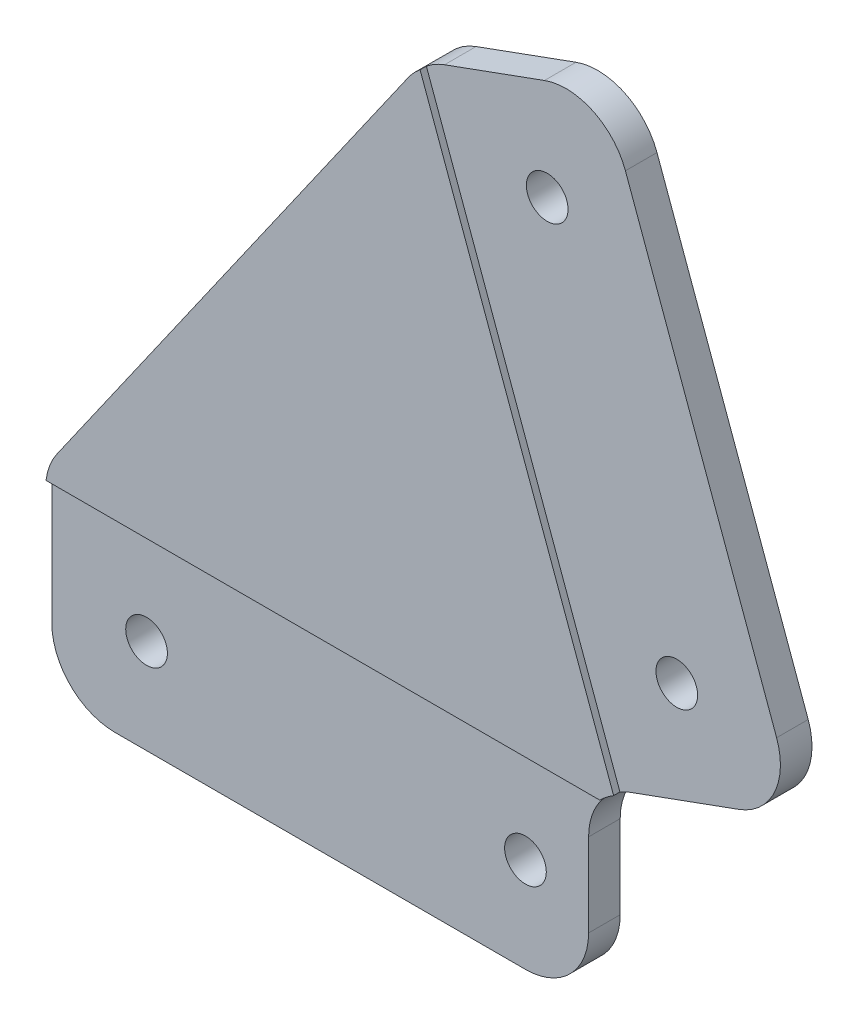
ISO-10303-21;
HEADER;
FILE_DESCRIPTION(('STEP AP214'),'2;1');
FILE_NAME('part.step','',(''),(''),'','','');
FILE_SCHEMA(('AUTOMOTIVE_DESIGN { 1 0 10303 214 1 1 1 1 }'));
ENDSEC;
DATA;
#1=APPLICATION_CONTEXT('core data for automotive mechanical design processes');
#2=APPLICATION_PROTOCOL_DEFINITION('international standard','automotive_design',2000,#1);
#3=PRODUCT_CONTEXT('',#1,'mechanical');
#4=PRODUCT('Part','Part','',(#3));
#5=PRODUCT_RELATED_PRODUCT_CATEGORY('part','',(#4));
#6=PRODUCT_DEFINITION_FORMATION('','',#4);
#7=PRODUCT_DEFINITION_CONTEXT('part definition',#1,'design');
#8=PRODUCT_DEFINITION('design','',#6,#7);
#9=PRODUCT_DEFINITION_SHAPE('','',#8);
#10=(LENGTH_UNIT() NAMED_UNIT(*) SI_UNIT(.MILLI.,.METRE.));
#11=(NAMED_UNIT(*) PLANE_ANGLE_UNIT() SI_UNIT($,.RADIAN.));
#12=(NAMED_UNIT(*) SI_UNIT($,.STERADIAN.) SOLID_ANGLE_UNIT());
#13=UNCERTAINTY_MEASURE_WITH_UNIT(LENGTH_MEASURE(1.E-05),#10,'distance_accuracy_value','');
#14=(GEOMETRIC_REPRESENTATION_CONTEXT(3) GLOBAL_UNCERTAINTY_ASSIGNED_CONTEXT((#13)) GLOBAL_UNIT_ASSIGNED_CONTEXT((#10,
#11,#12)) REPRESENTATION_CONTEXT('',''));
#15=CARTESIAN_POINT('',(0.,0.,0.));
#16=DIRECTION('',(0.,0.,1.));
#17=DIRECTION('',(1.,0.,0.));
#18=AXIS2_PLACEMENT_3D('',#15,#16,#17);
#19=CARTESIAN_POINT('',(51.4702225138264,-141.41327413104,3.));
#20=DIRECTION('',(0.342020143325674,-0.939692620785906,0.));
#21=DIRECTION('',(0.939692620785907,0.342020143325674,0.));
#22=AXIS2_PLACEMENT_3D('',#19,#20,#21);
#23=PLANE('',#22);
#24=DIRECTION('',(0.,0.,-1.));
#25=VECTOR('',#24,1.);
#26=CARTESIAN_POINT('',(449.396926207859,3.42020143325676,3.));
#27=LINE('',#26,#25);
#28=CARTESIAN_POINT('',(449.396926207859,3.42020143325675,0.));
#29=VERTEX_POINT('',#28);
#30=CARTESIAN_POINT('',(449.396926207859,3.42020143325676,2.5));
#31=VERTEX_POINT('',#30);
#32=EDGE_CURVE('E264',#29,#31,#27,.F.);
#33=ORIENTED_EDGE('',*,*,#32,.T.);
#34=DIRECTION('',(-0.939692620785907,-0.342020143325674,0.));
#35=VECTOR('',#34,1.);
#36=CARTESIAN_POINT('',(51.4702225138264,-141.41327413104,2.5));
#37=LINE('',#36,#35);
#38=CARTESIAN_POINT('',(440.789899283372,0.287499827215487,2.5));
#39=VERTEX_POINT('',#38);
#40=EDGE_CURVE('E327',#31,#39,#37,.T.);
#41=ORIENTED_EDGE('',*,*,#40,.T.);
#42=DIRECTION('',(0.,0.,-1.));
#43=VECTOR('',#42,1.);
#44=CARTESIAN_POINT('',(440.789899283372,0.287499827215478,0.));
#45=LINE('',#44,#43);
#46=CARTESIAN_POINT('',(440.789899283372,0.287499827215487,0.));
#47=VERTEX_POINT('',#46);
#48=EDGE_CURVE('E267',#39,#47,#45,.T.);
#49=ORIENTED_EDGE('',*,*,#48,.T.);
#50=DIRECTION('',(-0.939692620785907,-0.342020143325674,0.));
#51=VECTOR('',#50,1.);
#52=CARTESIAN_POINT('',(51.4702225138264,-141.41327413104,0.));
#53=LINE('',#52,#51);
#54=EDGE_CURVE('E355',#29,#47,#53,.T.);
#55=ORIENTED_EDGE('',*,*,#54,.F.);
#56=EDGE_LOOP('',(#33,#41,#49,#55));
#57=FACE_BOUND('',#56,.T.);
#58=ADVANCED_FACE('F49',(#57),#23,.T.);
#59=CARTESIAN_POINT('',(402.625166797963,146.543576280925,3.));
#60=DIRECTION('',(-0.939692620785907,-0.342020143325672,0.));
#61=DIRECTION('',(0.342020143325672,-0.939692620785907,0.));
#62=AXIS2_PLACEMENT_3D('',#59,#60,#61);
#63=PLANE('',#62);
#64=DIRECTION('',(-0.342020143325672,0.939692620785907,0.));
#65=VECTOR('',#64,1.);
#66=CARTESIAN_POINT('',(438.704482862133,47.416470085251,2.5));
#67=LINE('',#66,#65);
#68=CARTESIAN_POINT('',(452.38528859516,9.82876525381463,2.5));
#69=VERTEX_POINT('',#68);
#70=CARTESIAN_POINT('',(440.414583578762,42.7180069813214,2.5));
#71=VERTEX_POINT('',#70);
#72=EDGE_CURVE('E369',#69,#71,#67,.T.);
#73=ORIENTED_EDGE('',*,*,#72,.F.);
#74=DIRECTION('',(0.,0.,-1.));
#75=VECTOR('',#74,1.);
#76=CARTESIAN_POINT('',(452.38528859516,9.82876525381463,0.));
#77=LINE('',#76,#75);
#78=CARTESIAN_POINT('',(452.38528859516,9.82876525381463,0.));
#79=VERTEX_POINT('',#78);
#80=EDGE_CURVE('E277',#69,#79,#77,.T.);
#81=ORIENTED_EDGE('',*,*,#80,.T.);
#82=DIRECTION('',(-0.342020143325672,0.939692620785907,0.));
#83=VECTOR('',#82,1.);
#84=CARTESIAN_POINT('',(402.625166797963,146.543576280925,0.));
#85=LINE('',#84,#83);
#86=CARTESIAN_POINT('',(440.414583578762,42.7180069813214,0.));
#87=VERTEX_POINT('',#86);
#88=EDGE_CURVE('E258',#79,#87,#85,.T.);
#89=ORIENTED_EDGE('',*,*,#88,.T.);
#90=DIRECTION('',(0.,0.,-1.));
#91=VECTOR('',#90,1.);
#92=CARTESIAN_POINT('',(440.414583578762,42.7180069813214,3.));
#93=LINE('',#92,#91);
#94=EDGE_CURVE('E274',#87,#71,#93,.F.);
#95=ORIENTED_EDGE('',*,*,#94,.T.);
#96=EDGE_LOOP('',(#73,#81,#89,#95));
#97=FACE_BOUND('',#96,.T.);
#98=ADVANCED_FACE('F361',(#97),#63,.F.);
#99=CARTESIAN_POINT('',(36.0793160641703,-99.1271061956736,3.));
#100=DIRECTION('',(-0.342020143325671,0.939692620785908,0.));
#101=DIRECTION('',(-0.939692620785908,-0.342020143325671,0.));
#102=AXIS2_PLACEMENT_3D('',#99,#100,#101);
#103=PLANE('',#102);
#104=DIRECTION('',(0.,0.,-1.));
#105=VECTOR('',#104,1.);
#106=CARTESIAN_POINT('',(426.090513276606,42.8253606201798,3.));
#107=LINE('',#106,#105);
#108=CARTESIAN_POINT('',(426.090513276606,42.8253606201799,0.));
#109=VERTEX_POINT('',#108);
#110=CARTESIAN_POINT('',(426.090513276606,42.8253606201798,2.5));
#111=VERTEX_POINT('',#110);
#112=EDGE_CURVE('E216',#109,#111,#107,.F.);
#113=ORIENTED_EDGE('',*,*,#112,.T.);
#114=DIRECTION('',(-0.939692620785907,-0.342020143325672,0.));
#115=VECTOR('',#114,1.);
#116=CARTESIAN_POINT('',(438.704482862133,47.416470085251,2.5));
#117=LINE('',#116,#115);
#118=CARTESIAN_POINT('',(434.006019758204,45.7063693686226,2.5));
#119=VERTEX_POINT('',#118);
#120=EDGE_CURVE('E64',#119,#111,#117,.T.);
#121=ORIENTED_EDGE('',*,*,#120,.F.);
#122=DIRECTION('',(0.,0.,-1.));
#123=VECTOR('',#122,1.);
#124=CARTESIAN_POINT('',(434.006019758204,45.7063693686226,0.));
#125=LINE('',#124,#123);
#126=CARTESIAN_POINT('',(434.006019758204,45.7063693686227,0.));
#127=VERTEX_POINT('',#126);
#128=EDGE_CURVE('E226',#119,#127,#125,.T.);
#129=ORIENTED_EDGE('',*,*,#128,.T.);
#130=DIRECTION('',(0.939692620785908,0.342020143325671,0.));
#131=VECTOR('',#130,1.);
#132=CARTESIAN_POINT('',(36.0793160641703,-99.1271061956736,0.));
#133=LINE('',#132,#131);
#134=EDGE_CURVE('E225',#109,#127,#133,.T.);
#135=ORIENTED_EDGE('',*,*,#134,.F.);
#136=EDGE_LOOP('',(#113,#121,#129,#135));
#137=FACE_BOUND('',#136,.T.);
#138=ADVANCED_FACE('F222',(#137),#103,.T.);
#139=CARTESIAN_POINT('',(444.482543580952,9.61284573083691,0.));
#140=DIRECTION('',(0.,0.,1.));
#141=DIRECTION('',(1.,0.,0.));
#142=AXIS2_PLACEMENT_3D('',#139,#140,#141);
#143=CYLINDRICAL_SURFACE('',#142,1.64999999999999);
#144=CARTESIAN_POINT('',(444.482543580952,9.61284573083691,0.));
#145=DIRECTION('',(0.,0.,1.));
#146=DIRECTION('',(1.,0.,0.));
#147=AXIS2_PLACEMENT_3D('',#144,#145,#146);
#148=CIRCLE('',#147,1.64999999999999);
#149=CARTESIAN_POINT('',(446.132543580952,9.61284573083691,0.));
#150=VERTEX_POINT('',#149);
#151=EDGE_CURVE('E339',#150,#150,#148,.T.);
#152=ORIENTED_EDGE('',*,*,#151,.F.);
#153=EDGE_LOOP('',(#152));
#154=FACE_BOUND('',#153,.T.);
#155=CARTESIAN_POINT('',(444.482543580952,9.61284573083691,2.5));
#156=DIRECTION('',(0.,0.,1.));
#157=DIRECTION('',(1.,0.,0.));
#158=AXIS2_PLACEMENT_3D('',#155,#156,#157);
#159=CIRCLE('',#158,1.64999999999999);
#160=CARTESIAN_POINT('',(446.132543580952,9.61284573083691,2.5));
#161=VERTEX_POINT('',#160);
#162=EDGE_CURVE('E335',#161,#161,#159,.F.);
#163=ORIENTED_EDGE('',*,*,#162,.F.);
#164=EDGE_LOOP('',(#163));
#165=FACE_BOUND('',#164,.T.);
#166=ADVANCED_FACE('F399',(#154,#165),#143,.F.);
#167=CARTESIAN_POINT('',(434.221939281182,37.8036243544141,0.));
#168=DIRECTION('',(0.,0.,1.));
#169=DIRECTION('',(1.,0.,0.));
#170=AXIS2_PLACEMENT_3D('',#167,#168,#169);
#171=CYLINDRICAL_SURFACE('',#170,1.64999999999999);
#172=CARTESIAN_POINT('',(434.221939281182,37.8036243544141,0.));
#173=DIRECTION('',(0.,0.,1.));
#174=DIRECTION('',(1.,0.,0.));
#175=AXIS2_PLACEMENT_3D('',#172,#173,#174);
#176=CIRCLE('',#175,1.64999999999999);
#177=CARTESIAN_POINT('',(435.871939281182,37.8036243544141,0.));
#178=VERTEX_POINT('',#177);
#179=EDGE_CURVE('E347',#178,#178,#176,.T.);
#180=ORIENTED_EDGE('',*,*,#179,.F.);
#181=EDGE_LOOP('',(#180));
#182=FACE_BOUND('',#181,.T.);
#183=CARTESIAN_POINT('',(434.221939281182,37.8036243544141,2.5));
#184=DIRECTION('',(0.,0.,1.));
#185=DIRECTION('',(1.,0.,0.));
#186=AXIS2_PLACEMENT_3D('',#183,#184,#185);
#187=CIRCLE('',#186,1.64999999999999);
#188=CARTESIAN_POINT('',(435.871939281182,37.8036243544141,2.5));
#189=VERTEX_POINT('',#188);
#190=EDGE_CURVE('E332',#189,#189,#187,.F.);
#191=ORIENTED_EDGE('',*,*,#190,.F.);
#192=EDGE_LOOP('',(#191));
#193=FACE_BOUND('',#192,.T.);
#194=ADVANCED_FACE('F392',(#182,#193),#171,.F.);
#195=CARTESIAN_POINT('',(447.686825491231,8.11866453718629,3.));
#196=DIRECTION('',(0.,0.,1.));
#197=DIRECTION('',(1.,0.,0.));
#198=AXIS2_PLACEMENT_3D('',#195,#196,#197);
#199=CYLINDRICAL_SURFACE('',#198,5.);
#200=ORIENTED_EDGE('',*,*,#80,.F.);
#201=CARTESIAN_POINT('',(447.686825491231,8.11866453718629,2.5));
#202=DIRECTION('',(0.,0.,1.));
#203=DIRECTION('',(1.,0.,0.));
#204=AXIS2_PLACEMENT_3D('',#201,#202,#203);
#205=CIRCLE('',#204,5.);
#206=EDGE_CURVE('E324',#69,#31,#205,.F.);
#207=ORIENTED_EDGE('',*,*,#206,.T.);
#208=ORIENTED_EDGE('',*,*,#32,.F.);
#209=CARTESIAN_POINT('',(447.686825491231,8.11866453718629,0.));
#210=DIRECTION('',(0.,0.,1.));
#211=DIRECTION('',(1.,0.,0.));
#212=AXIS2_PLACEMENT_3D('',#209,#210,#211);
#213=CIRCLE('',#212,5.);
#214=EDGE_CURVE('E287',#79,#29,#213,.F.);
#215=ORIENTED_EDGE('',*,*,#214,.F.);
#216=EDGE_LOOP('',(#200,#207,#208,#215));
#217=FACE_BOUND('',#216,.T.);
#218=ADVANCED_FACE('F390',(#217),#199,.T.);
#219=CARTESIAN_POINT('',(435.716120474832,41.0079062646931,3.));
#220=DIRECTION('',(0.,0.,1.));
#221=DIRECTION('',(1.,0.,0.));
#222=AXIS2_PLACEMENT_3D('',#219,#220,#221);
#223=CYLINDRICAL_SURFACE('',#222,5.);
#224=ORIENTED_EDGE('',*,*,#128,.F.);
#225=CARTESIAN_POINT('',(435.716120474832,41.0079062646931,2.5));
#226=DIRECTION('',(0.,0.,1.));
#227=DIRECTION('',(1.,0.,0.));
#228=AXIS2_PLACEMENT_3D('',#225,#226,#227);
#229=CIRCLE('',#228,5.);
#230=EDGE_CURVE('E183',#119,#71,#229,.F.);
#231=ORIENTED_EDGE('',*,*,#230,.T.);
#232=ORIENTED_EDGE('',*,*,#94,.F.);
#233=CARTESIAN_POINT('',(435.716120474832,41.0079062646931,0.));
#234=DIRECTION('',(0.,0.,1.));
#235=DIRECTION('',(1.,0.,0.));
#236=AXIS2_PLACEMENT_3D('',#233,#234,#235);
#237=CIRCLE('',#236,5.);
#238=EDGE_CURVE('E283',#127,#87,#237,.F.);
#239=ORIENTED_EDGE('',*,*,#238,.F.);
#240=EDGE_LOOP('',(#224,#231,#232,#239));
#241=FACE_BOUND('',#240,.T.);
#242=ADVANCED_FACE('F366',(#241),#223,.T.);
#243=CARTESIAN_POINT('',(437.5,0.,3.));
#244=DIRECTION('',(1.,0.,0.));
#245=DIRECTION('',(0.,0.,-1.));
#246=AXIS2_PLACEMENT_3D('',#243,#244,#245);
#247=PLANE('',#246);
#248=DIRECTION('',(0.,1.,0.));
#249=VECTOR('',#248,1.);
#250=CARTESIAN_POINT('',(437.5,0.,2.5));
#251=LINE('',#250,#249);
#252=CARTESIAN_POINT('',(437.5,-11.0000000000001,2.5));
#253=VERTEX_POINT('',#252);
#254=CARTESIAN_POINT('',(437.5,-4.41096327671406,2.5));
#255=VERTEX_POINT('',#254);
#256=EDGE_CURVE('E370',#253,#255,#251,.T.);
#257=ORIENTED_EDGE('',*,*,#256,.F.);
#258=DIRECTION('',(0.,0.,-1.));
#259=VECTOR('',#258,1.);
#260=CARTESIAN_POINT('',(437.5,-11.0000000000001,3.));
#261=LINE('',#260,#259);
#262=CARTESIAN_POINT('',(437.5,-11.0000000000001,0.));
#263=VERTEX_POINT('',#262);
#264=EDGE_CURVE('E269',#253,#263,#261,.T.);
#265=ORIENTED_EDGE('',*,*,#264,.T.);
#266=DIRECTION('',(0.,-1.,0.));
#267=VECTOR('',#266,1.);
#268=CARTESIAN_POINT('',(437.5,0.,0.));
#269=LINE('',#268,#267);
#270=CARTESIAN_POINT('',(437.5,-4.41096327671406,0.));
#271=VERTEX_POINT('',#270);
#272=EDGE_CURVE('E343',#271,#263,#269,.T.);
#273=ORIENTED_EDGE('',*,*,#272,.F.);
#274=DIRECTION('',(0.,0.,-1.));
#275=VECTOR('',#274,1.);
#276=CARTESIAN_POINT('',(437.5,-4.41096327671406,3.));
#277=LINE('',#276,#275);
#278=EDGE_CURVE('E271',#271,#255,#277,.F.);
#279=ORIENTED_EDGE('',*,*,#278,.T.);
#280=EDGE_LOOP('',(#257,#265,#273,#279));
#281=FACE_BOUND('',#280,.T.);
#282=ADVANCED_FACE('F382',(#281),#247,.T.);
#283=CARTESIAN_POINT('',(265.048978306821,-185.589292605216,3.));
#284=DIRECTION('',(0.819152044288994,-0.573576436351042,0.));
#285=DIRECTION('',(0.573576436351042,0.819152044288994,0.));
#286=AXIS2_PLACEMENT_3D('',#283,#284,#285);
#287=PLANE('',#286);
#288=DIRECTION('',(-0.573576436351042,-0.819152044288994,0.));
#289=VECTOR('',#288,1.);
#290=CARTESIAN_POINT('',(265.048978306821,-185.589292605216,3.));
#291=LINE('',#290,#289);
#292=CARTESIAN_POINT('',(423.704853771789,40.9947796980054,3.));
#293=VERTEX_POINT('',#292);
#294=CARTESIAN_POINT('',(395.904239778555,1.29138823736039,3.));
#295=VERTEX_POINT('',#294);
#296=EDGE_CURVE('E245',#293,#295,#291,.T.);
#297=ORIENTED_EDGE('',*,*,#296,.F.);
#298=DIRECTION('',(0.,0.,-1.));
#299=VECTOR('',#298,1.);
#300=CARTESIAN_POINT('',(423.704853771789,40.9947796980055,0.));
#301=LINE('',#300,#299);
#302=CARTESIAN_POINT('',(423.704853771789,40.9947796980054,0.));
#303=VERTEX_POINT('',#302);
#304=EDGE_CURVE('E207',#293,#303,#301,.T.);
#305=ORIENTED_EDGE('',*,*,#304,.T.);
#306=DIRECTION('',(-0.573576436351042,-0.819152044288994,0.));
#307=VECTOR('',#306,1.);
#308=CARTESIAN_POINT('',(265.048978306821,-185.589292605216,0.));
#309=LINE('',#308,#307);
#310=CARTESIAN_POINT('',(395.904239778555,1.29138823736039,0.));
#311=VERTEX_POINT('',#310);
#312=EDGE_CURVE('E243',#303,#311,#309,.T.);
#313=ORIENTED_EDGE('',*,*,#312,.T.);
#314=DIRECTION('',(0.,0.,-1.));
#315=VECTOR('',#314,1.);
#316=CARTESIAN_POINT('',(395.904239778555,1.29138823736039,3.));
#317=LINE('',#316,#315);
#318=EDGE_CURVE('E229',#311,#295,#317,.F.);
#319=ORIENTED_EDGE('',*,*,#318,.T.);
#320=EDGE_LOOP('',(#297,#305,#313,#319));
#321=FACE_BOUND('',#320,.T.);
#322=ADVANCED_FACE('F242',(#321),#287,.F.);
#323=CARTESIAN_POINT('',(395.,0.,3.));
#324=DIRECTION('',(1.,0.,0.));
#325=DIRECTION('',(0.,0.,-1.));
#326=AXIS2_PLACEMENT_3D('',#323,#324,#325);
#327=PLANE('',#326);
#328=DIRECTION('',(0.,0.,-1.));
#329=VECTOR('',#328,1.);
#330=CARTESIAN_POINT('',(395.,-11.,3.));
#331=LINE('',#330,#329);
#332=CARTESIAN_POINT('',(395.,-11.,0.));
#333=VERTEX_POINT('',#332);
#334=CARTESIAN_POINT('',(395.,-11.,2.5));
#335=VERTEX_POINT('',#334);
#336=EDGE_CURVE('E227',#333,#335,#331,.F.);
#337=ORIENTED_EDGE('',*,*,#336,.T.);
#338=DIRECTION('',(0.,-1.,0.));
#339=VECTOR('',#338,1.);
#340=CARTESIAN_POINT('',(395.,-16.0000000000001,2.5));
#341=LINE('',#340,#339);
#342=CARTESIAN_POINT('',(395.,-1.57649394439481,2.5));
#343=VERTEX_POINT('',#342);
#344=EDGE_CURVE('E196',#343,#335,#341,.T.);
#345=ORIENTED_EDGE('',*,*,#344,.F.);
#346=DIRECTION('',(0.,0.,-1.));
#347=VECTOR('',#346,1.);
#348=CARTESIAN_POINT('',(395.,-1.57649394439481,3.));
#349=LINE('',#348,#347);
#350=CARTESIAN_POINT('',(395.,-1.57649394439481,0.));
#351=VERTEX_POINT('',#350);
#352=EDGE_CURVE('E232',#343,#351,#349,.T.);
#353=ORIENTED_EDGE('',*,*,#352,.T.);
#354=DIRECTION('',(0.,-1.,0.));
#355=VECTOR('',#354,1.);
#356=CARTESIAN_POINT('',(395.,0.,0.));
#357=LINE('',#356,#355);
#358=EDGE_CURVE('E253',#351,#333,#357,.T.);
#359=ORIENTED_EDGE('',*,*,#358,.T.);
#360=EDGE_LOOP('',(#337,#345,#353,#359));
#361=FACE_BOUND('',#360,.T.);
#362=ADVANCED_FACE('F299',(#361),#327,.F.);
#363=CARTESIAN_POINT('',(0.,-15.9999999999991,3.));
#364=DIRECTION('',(0.,-1.,0.));
#365=DIRECTION('',(1.,0.,0.));
#366=AXIS2_PLACEMENT_3D('',#363,#364,#365);
#367=PLANE('',#366);
#368=DIRECTION('',(1.,0.,0.));
#369=VECTOR('',#368,1.);
#370=CARTESIAN_POINT('',(395.,-16.0000000000001,2.5));
#371=LINE('',#370,#369);
#372=CARTESIAN_POINT('',(400.,-16.0000000000001,2.5));
#373=VERTEX_POINT('',#372);
#374=CARTESIAN_POINT('',(432.5,-16.0000000000001,2.5));
#375=VERTEX_POINT('',#374);
#376=EDGE_CURVE('E72',#373,#375,#371,.T.);
#377=ORIENTED_EDGE('',*,*,#376,.F.);
#378=DIRECTION('',(0.,0.,-1.));
#379=VECTOR('',#378,1.);
#380=CARTESIAN_POINT('',(400.,-16.,0.));
#381=LINE('',#380,#379);
#382=CARTESIAN_POINT('',(400.,-16.,0.));
#383=VERTEX_POINT('',#382);
#384=EDGE_CURVE('E295',#373,#383,#381,.T.);
#385=ORIENTED_EDGE('',*,*,#384,.T.);
#386=DIRECTION('',(-1.,0.,0.));
#387=VECTOR('',#386,1.);
#388=CARTESIAN_POINT('',(0.,-15.9999999999991,0.));
#389=LINE('',#388,#387);
#390=CARTESIAN_POINT('',(432.5,-16.0000000000001,0.));
#391=VERTEX_POINT('',#390);
#392=EDGE_CURVE('E256',#391,#383,#389,.T.);
#393=ORIENTED_EDGE('',*,*,#392,.F.);
#394=DIRECTION('',(0.,0.,-1.));
#395=VECTOR('',#394,1.);
#396=CARTESIAN_POINT('',(432.5,-16.0000000000001,3.));
#397=LINE('',#396,#395);
#398=EDGE_CURVE('E292',#391,#375,#397,.F.);
#399=ORIENTED_EDGE('',*,*,#398,.T.);
#400=EDGE_LOOP('',(#377,#385,#393,#399));
#401=FACE_BOUND('',#400,.T.);
#402=ADVANCED_FACE('F438',(#401),#367,.T.);
#403=CARTESIAN_POINT('',(0.,0.,3.));
#404=DIRECTION('',(0.,0.,1.));
#405=DIRECTION('',(1.,0.,0.));
#406=AXIS2_PLACEMENT_3D('',#403,#404,#405);
#407=PLANE('',#406);
#408=DIRECTION('',(-1.,0.,0.));
#409=VECTOR('',#408,1.);
#410=CARTESIAN_POINT('',(395.,-0.950000000000086,3.));
#411=LINE('',#410,#409);
#412=CARTESIAN_POINT('',(438.891436130919,-0.950000000000078,3.));
#413=VERTEX_POINT('',#412);
#414=CARTESIAN_POINT('',(395.039404739587,-0.950000000000086,3.));
#415=VERTEX_POINT('',#414);
#416=EDGE_CURVE('E176',#413,#415,#411,.T.);
#417=ORIENTED_EDGE('',*,*,#416,.F.);
#418=CARTESIAN_POINT('',(442.5,-4.41096327671406,3.));
#419=DIRECTION('',(0.,0.,1.));
#420=DIRECTION('',(1.,0.,0.));
#421=AXIS2_PLACEMENT_3D('',#418,#419,#420);
#422=CIRCLE('',#421,5.);
#423=CARTESIAN_POINT('',(439.980361560203,-0.0922340501130058,3.));
#424=VERTEX_POINT('',#423);
#425=EDGE_CURVE('E191',#413,#424,#422,.F.);
#426=ORIENTED_EDGE('',*,*,#425,.T.);
#427=DIRECTION('',(0.342020143325672,-0.939692620785907,0.));
#428=VECTOR('',#427,1.);
#429=CARTESIAN_POINT('',(424.562108919305,42.2690669281996,3.));
#430=LINE('',#429,#428);
#431=CARTESIAN_POINT('',(424.655119103751,42.0135235466566,3.));
#432=VERTEX_POINT('',#431);
#433=EDGE_CURVE('E195',#432,#424,#430,.T.);
#434=ORIENTED_EDGE('',*,*,#433,.F.);
#435=CARTESIAN_POINT('',(427.800613993234,38.1268975162503,3.));
#436=DIRECTION('',(0.,0.,1.));
#437=DIRECTION('',(1.,0.,0.));
#438=AXIS2_PLACEMENT_3D('',#435,#436,#437);
#439=CIRCLE('',#438,5.);
#440=EDGE_CURVE('E290',#432,#293,#439,.T.);
#441=ORIENTED_EDGE('',*,*,#440,.T.);
#442=ORIENTED_EDGE('',*,*,#296,.T.);
#443=CARTESIAN_POINT('',(400.,-1.57649394439481,3.));
#444=DIRECTION('',(0.,0.,1.));
#445=DIRECTION('',(1.,0.,0.));
#446=AXIS2_PLACEMENT_3D('',#443,#444,#445);
#447=CIRCLE('',#446,5.);
#448=EDGE_CURVE('E194',#295,#415,#447,.T.);
#449=ORIENTED_EDGE('',*,*,#448,.T.);
#450=EDGE_LOOP('',(#417,#426,#434,#441,#442,#449));
#451=FACE_BOUND('',#450,.T.);
#452=ADVANCED_FACE('F189',(#451),#407,.T.);
#453=CARTESIAN_POINT('',(0.,0.,0.));
#454=DIRECTION('',(0.,0.,1.));
#455=DIRECTION('',(1.,0.,0.));
#456=AXIS2_PLACEMENT_3D('',#453,#454,#455);
#457=PLANE('',#456);
#458=CARTESIAN_POINT('',(402.5,-8.5000000000001,0.));
#459=DIRECTION('',(0.,0.,1.));
#460=DIRECTION('',(1.,0.,0.));
#461=AXIS2_PLACEMENT_3D('',#458,#459,#460);
#462=CIRCLE('',#461,1.64999999999999);
#463=CARTESIAN_POINT('',(404.15,-8.5000000000001,0.));
#464=VERTEX_POINT('',#463);
#465=EDGE_CURVE('E340',#464,#464,#462,.T.);
#466=ORIENTED_EDGE('',*,*,#465,.T.);
#467=EDGE_LOOP('',(#466));
#468=FACE_BOUND('',#467,.T.);
#469=CARTESIAN_POINT('',(432.5,-8.5000000000001,0.));
#470=DIRECTION('',(0.,0.,1.));
#471=DIRECTION('',(1.,0.,0.));
#472=AXIS2_PLACEMENT_3D('',#469,#470,#471);
#473=CIRCLE('',#472,1.64999999999999);
#474=CARTESIAN_POINT('',(434.15,-8.5000000000001,0.));
#475=VERTEX_POINT('',#474);
#476=EDGE_CURVE('E344',#475,#475,#473,.T.);
#477=ORIENTED_EDGE('',*,*,#476,.T.);
#478=EDGE_LOOP('',(#477));
#479=FACE_BOUND('',#478,.T.);
#480=ORIENTED_EDGE('',*,*,#179,.T.);
#481=EDGE_LOOP('',(#480));
#482=FACE_BOUND('',#481,.T.);
#483=ORIENTED_EDGE('',*,*,#151,.T.);
#484=EDGE_LOOP('',(#483));
#485=FACE_BOUND('',#484,.T.);
#486=ORIENTED_EDGE('',*,*,#88,.F.);
#487=ORIENTED_EDGE('',*,*,#214,.T.);
#488=ORIENTED_EDGE('',*,*,#54,.T.);
#489=CARTESIAN_POINT('',(442.5,-4.41096327671406,0.));
#490=DIRECTION('',(0.,0.,1.));
#491=DIRECTION('',(1.,0.,0.));
#492=AXIS2_PLACEMENT_3D('',#489,#490,#491);
#493=CIRCLE('',#492,5.);
#494=EDGE_CURVE('E203',#47,#271,#493,.T.);
#495=ORIENTED_EDGE('',*,*,#494,.T.);
#496=ORIENTED_EDGE('',*,*,#272,.T.);
#497=CARTESIAN_POINT('',(432.5,-11.0000000000001,0.));
#498=DIRECTION('',(0.,0.,1.));
#499=DIRECTION('',(1.,0.,0.));
#500=AXIS2_PLACEMENT_3D('',#497,#498,#499);
#501=CIRCLE('',#500,5.);
#502=EDGE_CURVE('E279',#263,#391,#501,.F.);
#503=ORIENTED_EDGE('',*,*,#502,.T.);
#504=ORIENTED_EDGE('',*,*,#392,.T.);
#505=CARTESIAN_POINT('',(400.,-11.,0.));
#506=DIRECTION('',(0.,0.,1.));
#507=DIRECTION('',(1.,0.,0.));
#508=AXIS2_PLACEMENT_3D('',#505,#506,#507);
#509=CIRCLE('',#508,5.);
#510=EDGE_CURVE('E285',#383,#333,#509,.F.);
#511=ORIENTED_EDGE('',*,*,#510,.T.);
#512=ORIENTED_EDGE('',*,*,#358,.F.);
#513=CARTESIAN_POINT('',(400.,-1.57649394439481,0.));
#514=DIRECTION('',(0.,0.,1.));
#515=DIRECTION('',(1.,0.,0.));
#516=AXIS2_PLACEMENT_3D('',#513,#514,#515);
#517=CIRCLE('',#516,5.);
#518=EDGE_CURVE('E252',#351,#311,#517,.F.);
#519=ORIENTED_EDGE('',*,*,#518,.T.);
#520=ORIENTED_EDGE('',*,*,#312,.F.);
#521=CARTESIAN_POINT('',(427.800613993234,38.1268975162503,0.));
#522=DIRECTION('',(0.,0.,1.));
#523=DIRECTION('',(1.,0.,0.));
#524=AXIS2_PLACEMENT_3D('',#521,#522,#523);
#525=CIRCLE('',#524,5.);
#526=EDGE_CURVE('E249',#303,#109,#525,.F.);
#527=ORIENTED_EDGE('',*,*,#526,.T.);
#528=ORIENTED_EDGE('',*,*,#134,.T.);
#529=ORIENTED_EDGE('',*,*,#238,.T.);
#530=EDGE_LOOP('',(#486,#487,#488,#495,#496,#503,#504,#511,#512,#519,#520,#527,#528,#529));
#531=FACE_BOUND('',#530,.T.);
#532=ADVANCED_FACE('F248',(#468,#479,#482,#485,#531),#457,.F.);
#533=CARTESIAN_POINT('',(432.5,-8.5000000000001,0.));
#534=DIRECTION('',(0.,0.,1.));
#535=DIRECTION('',(1.,0.,0.));
#536=AXIS2_PLACEMENT_3D('',#533,#534,#535);
#537=CYLINDRICAL_SURFACE('',#536,1.64999999999999);
#538=CARTESIAN_POINT('',(432.5,-8.5000000000001,2.5));
#539=DIRECTION('',(0.,0.,-1.));
#540=DIRECTION('',(-1.,0.,0.));
#541=AXIS2_PLACEMENT_3D('',#538,#539,#540);
#542=CIRCLE('',#541,1.64999999999999);
#543=CARTESIAN_POINT('',(430.85,-8.5000000000001,2.5));
#544=VERTEX_POINT('',#543);
#545=EDGE_CURVE('E184',#544,#544,#542,.F.);
#546=ORIENTED_EDGE('',*,*,#545,.T.);
#547=EDGE_LOOP('',(#546));
#548=FACE_BOUND('',#547,.T.);
#549=ORIENTED_EDGE('',*,*,#476,.F.);
#550=EDGE_LOOP('',(#549));
#551=FACE_BOUND('',#550,.T.);
#552=ADVANCED_FACE('F420',(#548,#551),#537,.F.);
#553=CARTESIAN_POINT('',(402.5,-8.5000000000001,0.));
#554=DIRECTION('',(0.,0.,1.));
#555=DIRECTION('',(1.,0.,0.));
#556=AXIS2_PLACEMENT_3D('',#553,#554,#555);
#557=CYLINDRICAL_SURFACE('',#556,1.64999999999999);
#558=CARTESIAN_POINT('',(402.5,-8.5000000000001,2.5));
#559=DIRECTION('',(0.,0.,-1.));
#560=DIRECTION('',(-1.,0.,0.));
#561=AXIS2_PLACEMENT_3D('',#558,#559,#560);
#562=CIRCLE('',#561,1.64999999999999);
#563=CARTESIAN_POINT('',(400.85,-8.5000000000001,2.5));
#564=VERTEX_POINT('',#563);
#565=EDGE_CURVE('E311',#564,#564,#562,.F.);
#566=ORIENTED_EDGE('',*,*,#565,.T.);
#567=EDGE_LOOP('',(#566));
#568=FACE_BOUND('',#567,.T.);
#569=ORIENTED_EDGE('',*,*,#465,.F.);
#570=EDGE_LOOP('',(#569));
#571=FACE_BOUND('',#570,.T.);
#572=ADVANCED_FACE('F415',(#568,#571),#557,.F.);
#573=CARTESIAN_POINT('',(442.5,-4.41096327671406,3.));
#574=DIRECTION('',(0.,0.,1.));
#575=DIRECTION('',(1.,0.,0.));
#576=AXIS2_PLACEMENT_3D('',#573,#574,#575);
#577=CYLINDRICAL_SURFACE('',#576,5.);
#578=ORIENTED_EDGE('',*,*,#425,.F.);
#579=DIRECTION('',(0.,0.,1.));
#580=VECTOR('',#579,1.);
#581=CARTESIAN_POINT('',(438.891436130919,-0.950000000000078,3.));
#582=LINE('',#581,#580);
#583=CARTESIAN_POINT('',(438.891436130919,-0.950000000000078,2.5));
#584=VERTEX_POINT('',#583);
#585=EDGE_CURVE('E173',#413,#584,#582,.F.);
#586=ORIENTED_EDGE('',*,*,#585,.T.);
#587=CARTESIAN_POINT('',(442.5,-4.41096327671406,2.5));
#588=DIRECTION('',(0.,0.,-1.));
#589=DIRECTION('',(-1.,0.,0.));
#590=AXIS2_PLACEMENT_3D('',#587,#588,#589);
#591=CIRCLE('',#590,5.);
#592=EDGE_CURVE('E316',#584,#255,#591,.F.);
#593=ORIENTED_EDGE('',*,*,#592,.T.);
#594=ORIENTED_EDGE('',*,*,#278,.F.);
#595=ORIENTED_EDGE('',*,*,#494,.F.);
#596=ORIENTED_EDGE('',*,*,#48,.F.);
#597=CARTESIAN_POINT('',(442.5,-4.41096327671406,2.5));
#598=DIRECTION('',(0.,0.,1.));
#599=DIRECTION('',(1.,0.,0.));
#600=AXIS2_PLACEMENT_3D('',#597,#598,#599);
#601=CIRCLE('',#600,5.);
#602=CARTESIAN_POINT('',(439.980361560203,-0.0922340501130058,2.5));
#603=VERTEX_POINT('',#602);
#604=EDGE_CURVE('E330',#603,#39,#601,.F.);
#605=ORIENTED_EDGE('',*,*,#604,.F.);
#606=DIRECTION('',(0.,0.,1.));
#607=VECTOR('',#606,1.);
#608=CARTESIAN_POINT('',(439.980361560203,-0.0922340501130067,3.));
#609=LINE('',#608,#607);
#610=EDGE_CURVE('E201',#603,#424,#609,.T.);
#611=ORIENTED_EDGE('',*,*,#610,.T.);
#612=EDGE_LOOP('',(#578,#586,#593,#594,#595,#596,#605,#611));
#613=FACE_BOUND('',#612,.T.);
#614=ADVANCED_FACE('F199',(#613),#577,.F.);
#615=CARTESIAN_POINT('',(400.,-11.,3.));
#616=DIRECTION('',(0.,0.,1.));
#617=DIRECTION('',(1.,0.,0.));
#618=AXIS2_PLACEMENT_3D('',#615,#616,#617);
#619=CYLINDRICAL_SURFACE('',#618,5.);
#620=CARTESIAN_POINT('',(400.,-11.,2.5));
#621=DIRECTION('',(0.,0.,-1.));
#622=DIRECTION('',(-1.,0.,0.));
#623=AXIS2_PLACEMENT_3D('',#620,#621,#622);
#624=CIRCLE('',#623,5.);
#625=EDGE_CURVE('E310',#335,#373,#624,.F.);
#626=ORIENTED_EDGE('',*,*,#625,.F.);
#627=ORIENTED_EDGE('',*,*,#336,.F.);
#628=ORIENTED_EDGE('',*,*,#510,.F.);
#629=ORIENTED_EDGE('',*,*,#384,.F.);
#630=EDGE_LOOP('',(#626,#627,#628,#629));
#631=FACE_BOUND('',#630,.T.);
#632=ADVANCED_FACE('F309',(#631),#619,.T.);
#633=CARTESIAN_POINT('',(427.800613993234,38.1268975162503,3.));
#634=DIRECTION('',(0.,0.,1.));
#635=DIRECTION('',(1.,0.,0.));
#636=AXIS2_PLACEMENT_3D('',#633,#634,#635);
#637=CYLINDRICAL_SURFACE('',#636,5.);
#638=DIRECTION('',(0.,0.,1.));
#639=VECTOR('',#638,1.);
#640=CARTESIAN_POINT('',(424.655119103751,42.0135235466566,3.));
#641=LINE('',#640,#639);
#642=CARTESIAN_POINT('',(424.655119103751,42.0135235466566,2.5));
#643=VERTEX_POINT('',#642);
#644=EDGE_CURVE('E12',#643,#432,#641,.T.);
#645=ORIENTED_EDGE('',*,*,#644,.F.);
#646=CARTESIAN_POINT('',(427.800613993234,38.1268975162503,2.5));
#647=DIRECTION('',(0.,0.,1.));
#648=DIRECTION('',(1.,0.,0.));
#649=AXIS2_PLACEMENT_3D('',#646,#647,#648);
#650=CIRCLE('',#649,5.);
#651=EDGE_CURVE('E57',#643,#111,#650,.F.);
#652=ORIENTED_EDGE('',*,*,#651,.T.);
#653=ORIENTED_EDGE('',*,*,#112,.F.);
#654=ORIENTED_EDGE('',*,*,#526,.F.);
#655=ORIENTED_EDGE('',*,*,#304,.F.);
#656=ORIENTED_EDGE('',*,*,#440,.F.);
#657=EDGE_LOOP('',(#645,#652,#653,#654,#655,#656));
#658=FACE_BOUND('',#657,.T.);
#659=ADVANCED_FACE('F215',(#658),#637,.T.);
#660=CARTESIAN_POINT('',(400.,-1.57649394439481,3.));
#661=DIRECTION('',(0.,0.,-1.));
#662=DIRECTION('',(-1.,0.,0.));
#663=AXIS2_PLACEMENT_3D('',#660,#661,#662);
#664=CYLINDRICAL_SURFACE('',#663,5.);
#665=DIRECTION('',(0.,0.,-1.));
#666=VECTOR('',#665,1.);
#667=CARTESIAN_POINT('',(395.039404739587,-0.950000000000086,3.));
#668=LINE('',#667,#666);
#669=CARTESIAN_POINT('',(395.039404739587,-0.950000000000086,2.5));
#670=VERTEX_POINT('',#669);
#671=EDGE_CURVE('E205',#415,#670,#668,.T.);
#672=ORIENTED_EDGE('',*,*,#671,.F.);
#673=ORIENTED_EDGE('',*,*,#448,.F.);
#674=ORIENTED_EDGE('',*,*,#318,.F.);
#675=ORIENTED_EDGE('',*,*,#518,.F.);
#676=ORIENTED_EDGE('',*,*,#352,.F.);
#677=CARTESIAN_POINT('',(400.,-1.57649394439481,2.5));
#678=DIRECTION('',(0.,0.,-1.));
#679=DIRECTION('',(-1.,0.,0.));
#680=AXIS2_PLACEMENT_3D('',#677,#678,#679);
#681=CIRCLE('',#680,5.);
#682=EDGE_CURVE('E312',#670,#343,#681,.F.);
#683=ORIENTED_EDGE('',*,*,#682,.F.);
#684=EDGE_LOOP('',(#672,#673,#674,#675,#676,#683));
#685=FACE_BOUND('',#684,.T.);
#686=ADVANCED_FACE('F303',(#685),#664,.T.);
#687=CARTESIAN_POINT('',(432.5,-11.0000000000001,3.));
#688=DIRECTION('',(0.,0.,-1.));
#689=DIRECTION('',(-1.,0.,0.));
#690=AXIS2_PLACEMENT_3D('',#687,#688,#689);
#691=CYLINDRICAL_SURFACE('',#690,5.);
#692=CARTESIAN_POINT('',(432.5,-11.0000000000001,2.5));
#693=DIRECTION('',(0.,0.,-1.));
#694=DIRECTION('',(-1.,0.,0.));
#695=AXIS2_PLACEMENT_3D('',#692,#693,#694);
#696=CIRCLE('',#695,5.);
#697=EDGE_CURVE('E202',#375,#253,#696,.F.);
#698=ORIENTED_EDGE('',*,*,#697,.F.);
#699=ORIENTED_EDGE('',*,*,#398,.F.);
#700=ORIENTED_EDGE('',*,*,#502,.F.);
#701=ORIENTED_EDGE('',*,*,#264,.F.);
#702=EDGE_LOOP('',(#698,#699,#700,#701));
#703=FACE_BOUND('',#702,.T.);
#704=ADVANCED_FACE('F51',(#703),#691,.T.);
#705=CARTESIAN_POINT('',(395.,-0.950000000000086,2.5));
#706=DIRECTION('',(0.,1.,0.));
#707=DIRECTION('',(-1.,0.,0.));
#708=AXIS2_PLACEMENT_3D('',#705,#706,#707);
#709=PLANE('',#708);
#710=ORIENTED_EDGE('',*,*,#416,.T.);
#711=ORIENTED_EDGE('',*,*,#671,.T.);
#712=DIRECTION('',(-1.,0.,0.));
#713=VECTOR('',#712,1.);
#714=CARTESIAN_POINT('',(395.,-0.950000000000086,2.5));
#715=LINE('',#714,#713);
#716=EDGE_CURVE('E179',#584,#670,#715,.T.);
#717=ORIENTED_EDGE('',*,*,#716,.F.);
#718=ORIENTED_EDGE('',*,*,#585,.F.);
#719=EDGE_LOOP('',(#710,#711,#717,#718));
#720=FACE_BOUND('',#719,.T.);
#721=ADVANCED_FACE('F175',(#720),#709,.F.);
#722=CARTESIAN_POINT('',(0.,0.,2.5));
#723=DIRECTION('',(0.,0.,-1.));
#724=DIRECTION('',(-1.,0.,0.));
#725=AXIS2_PLACEMENT_3D('',#722,#723,#724);
#726=PLANE('',#725);
#727=ORIENTED_EDGE('',*,*,#565,.F.);
#728=EDGE_LOOP('',(#727));
#729=FACE_BOUND('',#728,.T.);
#730=ORIENTED_EDGE('',*,*,#625,.T.);
#731=ORIENTED_EDGE('',*,*,#376,.T.);
#732=ORIENTED_EDGE('',*,*,#697,.T.);
#733=ORIENTED_EDGE('',*,*,#256,.T.);
#734=ORIENTED_EDGE('',*,*,#592,.F.);
#735=ORIENTED_EDGE('',*,*,#716,.T.);
#736=ORIENTED_EDGE('',*,*,#682,.T.);
#737=ORIENTED_EDGE('',*,*,#344,.T.);
#738=EDGE_LOOP('',(#730,#731,#732,#733,#734,#735,#736,#737));
#739=FACE_BOUND('',#738,.T.);
#740=ORIENTED_EDGE('',*,*,#545,.F.);
#741=EDGE_LOOP('',(#740));
#742=FACE_BOUND('',#741,.T.);
#743=ADVANCED_FACE('F569',(#729,#739,#742),#726,.F.);
#744=CARTESIAN_POINT('',(424.562108919305,42.2690669281996,2.5));
#745=DIRECTION('',(-0.939692620785907,-0.342020143325672,0.));
#746=DIRECTION('',(0.342020143325672,-0.939692620785907,0.));
#747=AXIS2_PLACEMENT_3D('',#744,#745,#746);
#748=PLANE('',#747);
#749=DIRECTION('',(0.342020143325672,-0.939692620785907,0.));
#750=VECTOR('',#749,1.);
#751=CARTESIAN_POINT('',(424.562108919305,42.2690669281996,2.5));
#752=LINE('',#751,#750);
#753=EDGE_CURVE('E371',#643,#603,#752,.T.);
#754=ORIENTED_EDGE('',*,*,#753,.F.);
#755=ORIENTED_EDGE('',*,*,#644,.T.);
#756=ORIENTED_EDGE('',*,*,#433,.T.);
#757=ORIENTED_EDGE('',*,*,#610,.F.);
#758=EDGE_LOOP('',(#754,#755,#756,#757));
#759=FACE_BOUND('',#758,.T.);
#760=ADVANCED_FACE('F430',(#759),#748,.F.);
#761=CARTESIAN_POINT('',(0.,0.,2.5));
#762=DIRECTION('',(0.,0.,1.));
#763=DIRECTION('',(1.,0.,0.));
#764=AXIS2_PLACEMENT_3D('',#761,#762,#763);
#765=PLANE('',#764);
#766=ORIENTED_EDGE('',*,*,#604,.T.);
#767=ORIENTED_EDGE('',*,*,#40,.F.);
#768=ORIENTED_EDGE('',*,*,#206,.F.);
#769=ORIENTED_EDGE('',*,*,#72,.T.);
#770=ORIENTED_EDGE('',*,*,#230,.F.);
#771=ORIENTED_EDGE('',*,*,#120,.T.);
#772=ORIENTED_EDGE('',*,*,#651,.F.);
#773=ORIENTED_EDGE('',*,*,#753,.T.);
#774=EDGE_LOOP('',(#766,#767,#768,#769,#770,#771,#772,#773));
#775=FACE_BOUND('',#774,.T.);
#776=ORIENTED_EDGE('',*,*,#190,.T.);
#777=EDGE_LOOP('',(#776));
#778=FACE_BOUND('',#777,.T.);
#779=ORIENTED_EDGE('',*,*,#162,.T.);
#780=EDGE_LOOP('',(#779));
#781=FACE_BOUND('',#780,.T.);
#782=ADVANCED_FACE('F367',(#775,#778,#781),#765,.T.);
#783=CLOSED_SHELL('',(#58,#98,#138,#166,#194,#218,#242,#282,#322,#362,#402,#452,#532,#552,#572,
#614,#632,#659,#686,#704,#721,#743,#760,#782));
#784=MANIFOLD_SOLID_BREP('B2',#783);
#785=ADVANCED_BREP_SHAPE_REPRESENTATION('',(#18,#784),#14);
#786=SHAPE_DEFINITION_REPRESENTATION(#9,#785);
ENDSEC;
END-ISO-10303-21;
